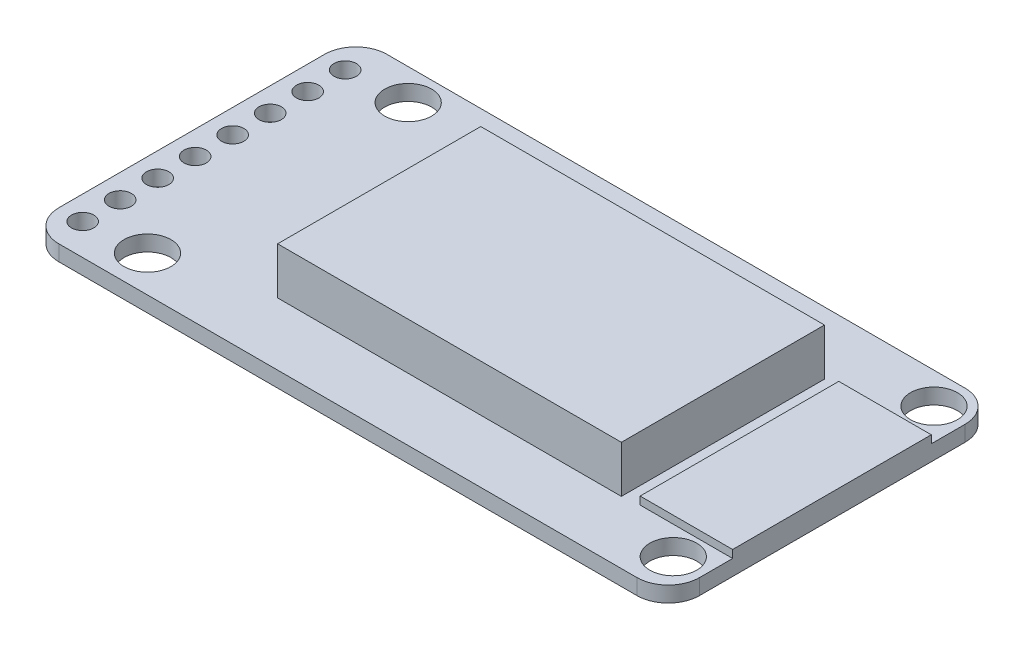
ISO-10303-21;
HEADER;
FILE_DESCRIPTION(('STEP AP214'),'2;1');
FILE_NAME('part.step','',(''),(''),'','','');
FILE_SCHEMA(('AUTOMOTIVE_DESIGN { 1 0 10303 214 1 1 1 1 }'));
ENDSEC;
DATA;
#1=APPLICATION_CONTEXT('core data for automotive mechanical design processes');
#2=APPLICATION_PROTOCOL_DEFINITION('international standard','automotive_design',2000,#1);
#3=PRODUCT_CONTEXT('',#1,'mechanical');
#4=PRODUCT('Part','Part','',(#3));
#5=PRODUCT_RELATED_PRODUCT_CATEGORY('part','',(#4));
#6=PRODUCT_DEFINITION_FORMATION('','',#4);
#7=PRODUCT_DEFINITION_CONTEXT('part definition',#1,'design');
#8=PRODUCT_DEFINITION('design','',#6,#7);
#9=PRODUCT_DEFINITION_SHAPE('','',#8);
#10=(LENGTH_UNIT() NAMED_UNIT(*) SI_UNIT(.MILLI.,.METRE.));
#11=(NAMED_UNIT(*) PLANE_ANGLE_UNIT() SI_UNIT($,.RADIAN.));
#12=(NAMED_UNIT(*) SI_UNIT($,.STERADIAN.) SOLID_ANGLE_UNIT());
#13=UNCERTAINTY_MEASURE_WITH_UNIT(LENGTH_MEASURE(1.E-05),#10,'distance_accuracy_value','');
#14=(GEOMETRIC_REPRESENTATION_CONTEXT(3) GLOBAL_UNCERTAINTY_ASSIGNED_CONTEXT((#13)) GLOBAL_UNIT_ASSIGNED_CONTEXT((#10,
#11,#12)) REPRESENTATION_CONTEXT('',''));
#15=CARTESIAN_POINT('',(0.,0.,0.));
#16=DIRECTION('',(0.,0.,1.));
#17=DIRECTION('',(1.,0.,0.));
#18=AXIS2_PLACEMENT_3D('',#15,#16,#17);
#19=CARTESIAN_POINT('',(0.,1.,0.));
#20=DIRECTION('',(0.,1.,0.));
#21=DIRECTION('',(0.,0.,1.));
#22=AXIS2_PLACEMENT_3D('',#19,#20,#21);
#23=PLANE('',#22);
#24=DIRECTION('',(0.,0.,-1.));
#25=VECTOR('',#24,1.);
#26=CARTESIAN_POINT('',(-8.49999999999999,1.,-10.5));
#27=LINE('',#26,#25);
#28=CARTESIAN_POINT('',(-8.49999999999999,1.,6.5));
#29=VERTEX_POINT('',#28);
#30=CARTESIAN_POINT('',(-8.49999999999999,1.,-6.5));
#31=VERTEX_POINT('',#30);
#32=EDGE_CURVE('E282',#29,#31,#27,.T.);
#33=ORIENTED_EDGE('',*,*,#32,.T.);
#34=DIRECTION('',(-1.,0.,0.));
#35=VECTOR('',#34,1.);
#36=CARTESIAN_POINT('',(-8.49999999999999,1.,-6.5));
#37=LINE('',#36,#35);
#38=CARTESIAN_POINT('',(13.5,1.,-6.5));
#39=VERTEX_POINT('',#38);
#40=EDGE_CURVE('E253',#39,#31,#37,.T.);
#41=ORIENTED_EDGE('',*,*,#40,.F.);
#42=DIRECTION('',(0.,0.,1.));
#43=VECTOR('',#42,1.);
#44=CARTESIAN_POINT('',(13.5,1.,-10.5));
#45=LINE('',#44,#43);
#46=CARTESIAN_POINT('',(13.5,1.,6.49999999999999));
#47=VERTEX_POINT('',#46);
#48=EDGE_CURVE('E274',#39,#47,#45,.T.);
#49=ORIENTED_EDGE('',*,*,#48,.T.);
#50=DIRECTION('',(1.,0.,0.));
#51=VECTOR('',#50,1.);
#52=CARTESIAN_POINT('',(-8.49999999999999,1.,6.5));
#53=LINE('',#52,#51);
#54=EDGE_CURVE('E251',#29,#47,#53,.T.);
#55=ORIENTED_EDGE('',*,*,#54,.F.);
#56=EDGE_LOOP('',(#33,#41,#49,#55));
#57=FACE_BOUND('',#56,.T.);
#58=CARTESIAN_POINT('',(-18.9757972728076,1.,8.49999999999999));
#59=DIRECTION('',(0.,1.,0.));
#60=DIRECTION('',(0.,0.,1.));
#61=AXIS2_PLACEMENT_3D('',#58,#59,#60);
#62=CIRCLE('',#61,0.71529936997648);
#63=CARTESIAN_POINT('',(-18.9757972728076,1.,9.21529936997647));
#64=VERTEX_POINT('',#63);
#65=EDGE_CURVE('E244',#64,#64,#62,.T.);
#66=ORIENTED_EDGE('',*,*,#65,.F.);
#67=EDGE_LOOP('',(#66));
#68=FACE_BOUND('',#67,.T.);
#69=CARTESIAN_POINT('',(-18.9757972728076,1.,6.1));
#70=DIRECTION('',(0.,1.,0.));
#71=DIRECTION('',(0.,0.,1.));
#72=AXIS2_PLACEMENT_3D('',#69,#70,#71);
#73=CIRCLE('',#72,0.71529936997648);
#74=CARTESIAN_POINT('',(-18.9757972728076,1.,6.81529936997648));
#75=VERTEX_POINT('',#74);
#76=EDGE_CURVE('E238',#75,#75,#73,.T.);
#77=ORIENTED_EDGE('',*,*,#76,.F.);
#78=EDGE_LOOP('',(#77));
#79=FACE_BOUND('',#78,.T.);
#80=CARTESIAN_POINT('',(-18.9757972728076,1.,3.7));
#81=DIRECTION('',(0.,1.,0.));
#82=DIRECTION('',(0.,0.,1.));
#83=AXIS2_PLACEMENT_3D('',#80,#81,#82);
#84=CIRCLE('',#83,0.71529936997648);
#85=CARTESIAN_POINT('',(-18.9757972728076,1.,4.41529936997648));
#86=VERTEX_POINT('',#85);
#87=EDGE_CURVE('E232',#86,#86,#84,.T.);
#88=ORIENTED_EDGE('',*,*,#87,.F.);
#89=EDGE_LOOP('',(#88));
#90=FACE_BOUND('',#89,.T.);
#91=CARTESIAN_POINT('',(-18.9757972728076,1.,1.3));
#92=DIRECTION('',(0.,1.,0.));
#93=DIRECTION('',(0.,0.,1.));
#94=AXIS2_PLACEMENT_3D('',#91,#92,#93);
#95=CIRCLE('',#94,0.71529936997648);
#96=CARTESIAN_POINT('',(-18.9757972728076,1.,2.01529936997648));
#97=VERTEX_POINT('',#96);
#98=EDGE_CURVE('E226',#97,#97,#95,.T.);
#99=ORIENTED_EDGE('',*,*,#98,.F.);
#100=EDGE_LOOP('',(#99));
#101=FACE_BOUND('',#100,.T.);
#102=CARTESIAN_POINT('',(-18.9757972728076,1.,-1.1));
#103=DIRECTION('',(0.,1.,0.));
#104=DIRECTION('',(0.,0.,1.));
#105=AXIS2_PLACEMENT_3D('',#102,#103,#104);
#106=CIRCLE('',#105,0.71529936997648);
#107=CARTESIAN_POINT('',(-18.9757972728076,1.,-0.384700630023524));
#108=VERTEX_POINT('',#107);
#109=EDGE_CURVE('E220',#108,#108,#106,.T.);
#110=ORIENTED_EDGE('',*,*,#109,.F.);
#111=EDGE_LOOP('',(#110));
#112=FACE_BOUND('',#111,.T.);
#113=CARTESIAN_POINT('',(-18.9757972728076,1.,-3.5));
#114=DIRECTION('',(0.,1.,0.));
#115=DIRECTION('',(0.,0.,1.));
#116=AXIS2_PLACEMENT_3D('',#113,#114,#115);
#117=CIRCLE('',#116,0.71529936997648);
#118=CARTESIAN_POINT('',(-18.9757972728076,1.,-2.78470063002352));
#119=VERTEX_POINT('',#118);
#120=EDGE_CURVE('E214',#119,#119,#117,.T.);
#121=ORIENTED_EDGE('',*,*,#120,.F.);
#122=EDGE_LOOP('',(#121));
#123=FACE_BOUND('',#122,.T.);
#124=CARTESIAN_POINT('',(-18.9757972728076,1.,-5.9));
#125=DIRECTION('',(0.,1.,0.));
#126=DIRECTION('',(0.,0.,1.));
#127=AXIS2_PLACEMENT_3D('',#124,#125,#126);
#128=CIRCLE('',#127,0.71529936997648);
#129=CARTESIAN_POINT('',(-18.9757972728076,1.,-5.18470063002352));
#130=VERTEX_POINT('',#129);
#131=EDGE_CURVE('E208',#130,#130,#128,.T.);
#132=ORIENTED_EDGE('',*,*,#131,.F.);
#133=EDGE_LOOP('',(#132));
#134=FACE_BOUND('',#133,.T.);
#135=CARTESIAN_POINT('',(-18.9757972728076,1.,-8.3));
#136=DIRECTION('',(0.,1.,0.));
#137=DIRECTION('',(0.,0.,1.));
#138=AXIS2_PLACEMENT_3D('',#135,#136,#137);
#139=CIRCLE('',#138,0.71529936997648);
#140=CARTESIAN_POINT('',(-18.9757972728076,1.,-7.58470063002352));
#141=VERTEX_POINT('',#140);
#142=EDGE_CURVE('E202',#141,#141,#139,.T.);
#143=ORIENTED_EDGE('',*,*,#142,.F.);
#144=EDGE_LOOP('',(#143));
#145=FACE_BOUND('',#144,.T.);
#146=CARTESIAN_POINT('',(-15.1499628617966,1.,-8.50645559511954));
#147=DIRECTION('',(0.,1.,0.));
#148=DIRECTION('',(0.,0.,1.));
#149=AXIS2_PLACEMENT_3D('',#146,#147,#148);
#150=CIRCLE('',#149,1.5);
#151=CARTESIAN_POINT('',(-15.1499628617966,1.,-7.00645559511953));
#152=VERTEX_POINT('',#151);
#153=EDGE_CURVE('E196',#152,#152,#150,.T.);
#154=ORIENTED_EDGE('',*,*,#153,.F.);
#155=EDGE_LOOP('',(#154));
#156=FACE_BOUND('',#155,.T.);
#157=CARTESIAN_POINT('',(18.5,1.,-8.50645559511954));
#158=DIRECTION('',(0.,1.,0.));
#159=DIRECTION('',(0.,0.,1.));
#160=AXIS2_PLACEMENT_3D('',#157,#158,#159);
#161=CIRCLE('',#160,1.5);
#162=CARTESIAN_POINT('',(18.5,1.,-7.00645559511953));
#163=VERTEX_POINT('',#162);
#164=EDGE_CURVE('E190',#163,#163,#161,.T.);
#165=ORIENTED_EDGE('',*,*,#164,.F.);
#166=EDGE_LOOP('',(#165));
#167=FACE_BOUND('',#166,.T.);
#168=CARTESIAN_POINT('',(-15.1499628617966,1.,8.17817223405615));
#169=DIRECTION('',(0.,1.,0.));
#170=DIRECTION('',(0.,0.,1.));
#171=AXIS2_PLACEMENT_3D('',#168,#169,#170);
#172=CIRCLE('',#171,1.5);
#173=CARTESIAN_POINT('',(-15.1499628617966,1.,9.67817223405615));
#174=VERTEX_POINT('',#173);
#175=EDGE_CURVE('E184',#174,#174,#172,.T.);
#176=ORIENTED_EDGE('',*,*,#175,.F.);
#177=EDGE_LOOP('',(#176));
#178=FACE_BOUND('',#177,.T.);
#179=CARTESIAN_POINT('',(18.5,1.,8.17817223405614));
#180=DIRECTION('',(0.,1.,0.));
#181=DIRECTION('',(0.,0.,1.));
#182=AXIS2_PLACEMENT_3D('',#179,#180,#181);
#183=CIRCLE('',#182,1.5);
#184=CARTESIAN_POINT('',(18.5,1.,9.67817223405615));
#185=VERTEX_POINT('',#184);
#186=EDGE_CURVE('E174',#185,#185,#183,.T.);
#187=ORIENTED_EDGE('',*,*,#186,.F.);
#188=EDGE_LOOP('',(#187));
#189=FACE_BOUND('',#188,.T.);
#190=DIRECTION('',(0.,0.,1.));
#191=VECTOR('',#190,1.);
#192=CARTESIAN_POINT('',(14.5804071199531,1.,-6.33314280088722));
#193=LINE('',#192,#191);
#194=CARTESIAN_POINT('',(14.5804071199531,1.,-6.33314280088722));
#195=VERTEX_POINT('',#194);
#196=CARTESIAN_POINT('',(14.5804071199531,1.,6.38040506059535));
#197=VERTEX_POINT('',#196);
#198=EDGE_CURVE('E368',#195,#197,#193,.T.);
#199=ORIENTED_EDGE('',*,*,#198,.F.);
#200=DIRECTION('',(-1.,0.,0.));
#201=VECTOR('',#200,1.);
#202=CARTESIAN_POINT('',(20.5,1.,-6.33314280088722));
#203=LINE('',#202,#201);
#204=CARTESIAN_POINT('',(20.5,1.,-6.33314280088722));
#205=VERTEX_POINT('',#204);
#206=EDGE_CURVE('E370',#205,#195,#203,.T.);
#207=ORIENTED_EDGE('',*,*,#206,.F.);
#208=DIRECTION('',(0.,0.,-1.));
#209=VECTOR('',#208,1.);
#210=CARTESIAN_POINT('',(20.5,1.,-10.5));
#211=LINE('',#210,#209);
#212=CARTESIAN_POINT('',(20.5,1.,-8.5));
#213=VERTEX_POINT('',#212);
#214=EDGE_CURVE('E173',#205,#213,#211,.T.);
#215=ORIENTED_EDGE('',*,*,#214,.T.);
#216=CARTESIAN_POINT('',(18.5,1.,-8.5));
#217=DIRECTION('',(0.,1.,0.));
#218=DIRECTION('',(0.,0.,1.));
#219=AXIS2_PLACEMENT_3D('',#216,#217,#218);
#220=CIRCLE('',#219,2.);
#221=CARTESIAN_POINT('',(18.5,1.,-10.5));
#222=VERTEX_POINT('',#221);
#223=EDGE_CURVE('E322',#213,#222,#220,.T.);
#224=ORIENTED_EDGE('',*,*,#223,.T.);
#225=DIRECTION('',(-1.,0.,0.));
#226=VECTOR('',#225,1.);
#227=CARTESIAN_POINT('',(-20.5,1.,-10.5));
#228=LINE('',#227,#226);
#229=CARTESIAN_POINT('',(-18.5,1.,-10.5));
#230=VERTEX_POINT('',#229);
#231=EDGE_CURVE('E285',#222,#230,#228,.T.);
#232=ORIENTED_EDGE('',*,*,#231,.T.);
#233=CARTESIAN_POINT('',(-18.5,1.,-8.5));
#234=DIRECTION('',(0.,1.,0.));
#235=DIRECTION('',(0.,0.,1.));
#236=AXIS2_PLACEMENT_3D('',#233,#234,#235);
#237=CIRCLE('',#236,2.);
#238=CARTESIAN_POINT('',(-20.5,1.,-8.5));
#239=VERTEX_POINT('',#238);
#240=EDGE_CURVE('E326',#230,#239,#237,.T.);
#241=ORIENTED_EDGE('',*,*,#240,.T.);
#242=DIRECTION('',(0.,0.,1.));
#243=VECTOR('',#242,1.);
#244=CARTESIAN_POINT('',(-20.5,1.,-10.5));
#245=LINE('',#244,#243);
#246=CARTESIAN_POINT('',(-20.5,1.,8.49999999999999));
#247=VERTEX_POINT('',#246);
#248=EDGE_CURVE('E277',#239,#247,#245,.T.);
#249=ORIENTED_EDGE('',*,*,#248,.T.);
#250=CARTESIAN_POINT('',(-18.5,1.,8.5));
#251=DIRECTION('',(0.,1.,0.));
#252=DIRECTION('',(0.,0.,1.));
#253=AXIS2_PLACEMENT_3D('',#250,#251,#252);
#254=CIRCLE('',#253,2.);
#255=CARTESIAN_POINT('',(-18.5,1.,10.5));
#256=VERTEX_POINT('',#255);
#257=EDGE_CURVE('E328',#247,#256,#254,.T.);
#258=ORIENTED_EDGE('',*,*,#257,.T.);
#259=DIRECTION('',(1.,0.,0.));
#260=VECTOR('',#259,1.);
#261=CARTESIAN_POINT('',(-20.5,1.,10.5));
#262=LINE('',#261,#260);
#263=CARTESIAN_POINT('',(18.5,1.,10.5));
#264=VERTEX_POINT('',#263);
#265=EDGE_CURVE('E301',#256,#264,#262,.T.);
#266=ORIENTED_EDGE('',*,*,#265,.T.);
#267=CARTESIAN_POINT('',(18.5,1.,8.5));
#268=DIRECTION('',(0.,1.,0.));
#269=DIRECTION('',(0.,0.,1.));
#270=AXIS2_PLACEMENT_3D('',#267,#268,#269);
#271=CIRCLE('',#270,2.);
#272=CARTESIAN_POINT('',(20.5,1.,8.49999999999999));
#273=VERTEX_POINT('',#272);
#274=EDGE_CURVE('E324',#264,#273,#271,.T.);
#275=ORIENTED_EDGE('',*,*,#274,.T.);
#276=CARTESIAN_POINT('',(20.5,1.,6.38040506059535));
#277=VERTEX_POINT('',#276);
#278=EDGE_CURVE('E271',#273,#277,#211,.T.);
#279=ORIENTED_EDGE('',*,*,#278,.T.);
#280=DIRECTION('',(1.,0.,0.));
#281=VECTOR('',#280,1.);
#282=CARTESIAN_POINT('',(20.5,1.,6.38040506059535));
#283=LINE('',#282,#281);
#284=EDGE_CURVE('E167',#197,#277,#283,.T.);
#285=ORIENTED_EDGE('',*,*,#284,.F.);
#286=EDGE_LOOP('',(#199,#207,#215,#224,#232,#241,#249,#258,#266,#275,#279,#285));
#287=FACE_BOUND('',#286,.T.);
#288=ADVANCED_FACE('F33',(#57,#68,#79,#90,#101,#112,#123,#134,#145,#156,#167,#178,#189,#287),
#23,.T.);
#289=CARTESIAN_POINT('',(-20.5,4.,-10.5));
#290=DIRECTION('',(0.,0.,1.));
#291=DIRECTION('',(1.,0.,0.));
#292=AXIS2_PLACEMENT_3D('',#289,#290,#291);
#293=PLANE('',#292);
#294=DIRECTION('',(-1.,0.,0.));
#295=VECTOR('',#294,1.);
#296=CARTESIAN_POINT('',(-20.5,0.,-10.5));
#297=LINE('',#296,#295);
#298=CARTESIAN_POINT('',(18.5,0.,-10.5));
#299=VERTEX_POINT('',#298);
#300=CARTESIAN_POINT('',(-18.5,0.,-10.5));
#301=VERTEX_POINT('',#300);
#302=EDGE_CURVE('E290',#299,#301,#297,.T.);
#303=ORIENTED_EDGE('',*,*,#302,.T.);
#304=DIRECTION('',(0.,-1.,0.));
#305=VECTOR('',#304,1.);
#306=CARTESIAN_POINT('',(-18.5,4.,-10.5));
#307=LINE('',#306,#305);
#308=EDGE_CURVE('E56',#301,#230,#307,.F.);
#309=ORIENTED_EDGE('',*,*,#308,.T.);
#310=ORIENTED_EDGE('',*,*,#231,.F.);
#311=DIRECTION('',(0.,-1.,0.));
#312=VECTOR('',#311,1.);
#313=CARTESIAN_POINT('',(18.5,4.,-10.5));
#314=LINE('',#313,#312);
#315=EDGE_CURVE('E330',#222,#299,#314,.T.);
#316=ORIENTED_EDGE('',*,*,#315,.T.);
#317=EDGE_LOOP('',(#303,#309,#310,#316));
#318=FACE_BOUND('',#317,.T.);
#319=ADVANCED_FACE('F341',(#318),#293,.F.);
#320=CARTESIAN_POINT('',(-20.5,4.,10.5));
#321=DIRECTION('',(0.,0.,-1.));
#322=DIRECTION('',(-1.,0.,0.));
#323=AXIS2_PLACEMENT_3D('',#320,#321,#322);
#324=PLANE('',#323);
#325=ORIENTED_EDGE('',*,*,#265,.F.);
#326=DIRECTION('',(0.,-1.,0.));
#327=VECTOR('',#326,1.);
#328=CARTESIAN_POINT('',(-18.5,4.,10.5));
#329=LINE('',#328,#327);
#330=CARTESIAN_POINT('',(-18.5,0.,10.5));
#331=VERTEX_POINT('',#330);
#332=EDGE_CURVE('E306',#256,#331,#329,.T.);
#333=ORIENTED_EDGE('',*,*,#332,.T.);
#334=DIRECTION('',(1.,0.,0.));
#335=VECTOR('',#334,1.);
#336=CARTESIAN_POINT('',(-20.5,0.,10.5));
#337=LINE('',#336,#335);
#338=CARTESIAN_POINT('',(18.5,0.,10.5));
#339=VERTEX_POINT('',#338);
#340=EDGE_CURVE('E295',#331,#339,#337,.T.);
#341=ORIENTED_EDGE('',*,*,#340,.T.);
#342=DIRECTION('',(0.,-1.,0.));
#343=VECTOR('',#342,1.);
#344=CARTESIAN_POINT('',(18.5,4.,10.5));
#345=LINE('',#344,#343);
#346=EDGE_CURVE('E304',#339,#264,#345,.F.);
#347=ORIENTED_EDGE('',*,*,#346,.T.);
#348=EDGE_LOOP('',(#325,#333,#341,#347));
#349=FACE_BOUND('',#348,.T.);
#350=ADVANCED_FACE('F360',(#349),#324,.F.);
#351=CARTESIAN_POINT('',(0.,4.,0.));
#352=DIRECTION('',(0.,-1.,0.));
#353=DIRECTION('',(0.,0.,-1.));
#354=AXIS2_PLACEMENT_3D('',#351,#352,#353);
#355=PLANE('',#354);
#356=DIRECTION('',(-1.,0.,0.));
#357=VECTOR('',#356,1.);
#358=CARTESIAN_POINT('',(-8.49999999999999,4.,-6.5));
#359=LINE('',#358,#357);
#360=CARTESIAN_POINT('',(13.5,4.,-6.5));
#361=VERTEX_POINT('',#360);
#362=CARTESIAN_POINT('',(-8.49999999999999,4.,-6.5));
#363=VERTEX_POINT('',#362);
#364=EDGE_CURVE('E254',#361,#363,#359,.T.);
#365=ORIENTED_EDGE('',*,*,#364,.T.);
#366=DIRECTION('',(0.,0.,1.));
#367=VECTOR('',#366,1.);
#368=CARTESIAN_POINT('',(-8.49999999999999,4.,0.));
#369=LINE('',#368,#367);
#370=CARTESIAN_POINT('',(-8.49999999999999,4.,6.5));
#371=VERTEX_POINT('',#370);
#372=EDGE_CURVE('E298',#363,#371,#369,.T.);
#373=ORIENTED_EDGE('',*,*,#372,.T.);
#374=DIRECTION('',(1.,0.,0.));
#375=VECTOR('',#374,1.);
#376=CARTESIAN_POINT('',(-8.49999999999999,4.,6.5));
#377=LINE('',#376,#375);
#378=CARTESIAN_POINT('',(13.5,4.,6.5));
#379=VERTEX_POINT('',#378);
#380=EDGE_CURVE('E250',#371,#379,#377,.T.);
#381=ORIENTED_EDGE('',*,*,#380,.T.);
#382=DIRECTION('',(0.,0.,1.));
#383=VECTOR('',#382,1.);
#384=CARTESIAN_POINT('',(13.5,4.,-10.5));
#385=LINE('',#384,#383);
#386=EDGE_CURVE('E263',#361,#379,#385,.T.);
#387=ORIENTED_EDGE('',*,*,#386,.F.);
#388=EDGE_LOOP('',(#365,#373,#381,#387));
#389=FACE_BOUND('',#388,.T.);
#390=ADVANCED_FACE('F402',(#389),#355,.F.);
#391=CARTESIAN_POINT('',(-8.49999999999999,1.,-10.5));
#392=DIRECTION('',(1.,0.,0.));
#393=DIRECTION('',(0.,0.,-1.));
#394=AXIS2_PLACEMENT_3D('',#391,#392,#393);
#395=PLANE('',#394);
#396=DIRECTION('',(0.,1.,0.));
#397=VECTOR('',#396,1.);
#398=CARTESIAN_POINT('',(-8.49999999999999,1.,-6.5));
#399=LINE('',#398,#397);
#400=EDGE_CURVE('E261',#31,#363,#399,.T.);
#401=ORIENTED_EDGE('',*,*,#400,.F.);
#402=ORIENTED_EDGE('',*,*,#32,.F.);
#403=DIRECTION('',(0.,1.,0.));
#404=VECTOR('',#403,1.);
#405=CARTESIAN_POINT('',(-8.49999999999999,1.,6.5));
#406=LINE('',#405,#404);
#407=EDGE_CURVE('E256',#29,#371,#406,.T.);
#408=ORIENTED_EDGE('',*,*,#407,.T.);
#409=ORIENTED_EDGE('',*,*,#372,.F.);
#410=EDGE_LOOP('',(#401,#402,#408,#409));
#411=FACE_BOUND('',#410,.T.);
#412=ADVANCED_FACE('F399',(#411),#395,.F.);
#413=CARTESIAN_POINT('',(13.5,1.,-10.5));
#414=DIRECTION('',(-1.,0.,0.));
#415=DIRECTION('',(0.,0.,1.));
#416=AXIS2_PLACEMENT_3D('',#413,#414,#415);
#417=PLANE('',#416);
#418=DIRECTION('',(0.,1.,0.));
#419=VECTOR('',#418,1.);
#420=CARTESIAN_POINT('',(13.5,1.,-6.5));
#421=LINE('',#420,#419);
#422=EDGE_CURVE('E264',#39,#361,#421,.T.);
#423=ORIENTED_EDGE('',*,*,#422,.T.);
#424=ORIENTED_EDGE('',*,*,#386,.T.);
#425=DIRECTION('',(0.,1.,0.));
#426=VECTOR('',#425,1.);
#427=CARTESIAN_POINT('',(13.5,1.,6.5));
#428=LINE('',#427,#426);
#429=EDGE_CURVE('E267',#47,#379,#428,.T.);
#430=ORIENTED_EDGE('',*,*,#429,.F.);
#431=ORIENTED_EDGE('',*,*,#48,.F.);
#432=EDGE_LOOP('',(#423,#424,#430,#431));
#433=FACE_BOUND('',#432,.T.);
#434=ADVANCED_FACE('F397',(#433),#417,.F.);
#435=CARTESIAN_POINT('',(20.5,4.,10.5));
#436=DIRECTION('',(-1.,0.,0.));
#437=DIRECTION('',(0.,0.,1.));
#438=AXIS2_PLACEMENT_3D('',#435,#436,#437);
#439=PLANE('',#438);
#440=ORIENTED_EDGE('',*,*,#278,.F.);
#441=DIRECTION('',(0.,-1.,0.));
#442=VECTOR('',#441,1.);
#443=CARTESIAN_POINT('',(20.5,4.,8.5));
#444=LINE('',#443,#442);
#445=CARTESIAN_POINT('',(20.5,0.,8.5));
#446=VERTEX_POINT('',#445);
#447=EDGE_CURVE('E12',#273,#446,#444,.T.);
#448=ORIENTED_EDGE('',*,*,#447,.T.);
#449=DIRECTION('',(0.,0.,-1.));
#450=VECTOR('',#449,1.);
#451=CARTESIAN_POINT('',(20.5,0.,10.5));
#452=LINE('',#451,#450);
#453=CARTESIAN_POINT('',(20.5,0.,-8.49999999999999));
#454=VERTEX_POINT('',#453);
#455=EDGE_CURVE('E287',#446,#454,#452,.T.);
#456=ORIENTED_EDGE('',*,*,#455,.T.);
#457=DIRECTION('',(0.,-1.,0.));
#458=VECTOR('',#457,1.);
#459=CARTESIAN_POINT('',(20.5,4.,-8.5));
#460=LINE('',#459,#458);
#461=EDGE_CURVE('E41',#454,#213,#460,.F.);
#462=ORIENTED_EDGE('',*,*,#461,.T.);
#463=ORIENTED_EDGE('',*,*,#214,.F.);
#464=DIRECTION('',(0.,-1.,0.));
#465=VECTOR('',#464,1.);
#466=CARTESIAN_POINT('',(20.5,1.5,-6.33314280088722));
#467=LINE('',#466,#465);
#468=CARTESIAN_POINT('',(20.5,1.5,-6.33314280088722));
#469=VERTEX_POINT('',#468);
#470=EDGE_CURVE('E152',#469,#205,#467,.T.);
#471=ORIENTED_EDGE('',*,*,#470,.F.);
#472=DIRECTION('',(0.,0.,-1.));
#473=VECTOR('',#472,1.);
#474=CARTESIAN_POINT('',(20.5,1.5,-6.33314280088722));
#475=LINE('',#474,#473);
#476=CARTESIAN_POINT('',(20.5,1.5,6.38040506059535));
#477=VERTEX_POINT('',#476);
#478=EDGE_CURVE('E159',#477,#469,#475,.T.);
#479=ORIENTED_EDGE('',*,*,#478,.F.);
#480=DIRECTION('',(0.,-1.,0.));
#481=VECTOR('',#480,1.);
#482=CARTESIAN_POINT('',(20.5,1.5,6.38040506059535));
#483=LINE('',#482,#481);
#484=EDGE_CURVE('E366',#477,#277,#483,.T.);
#485=ORIENTED_EDGE('',*,*,#484,.T.);
#486=EDGE_LOOP('',(#440,#448,#456,#462,#463,#471,#479,#485));
#487=FACE_BOUND('',#486,.T.);
#488=ADVANCED_FACE('F171',(#487),#439,.F.);
#489=CARTESIAN_POINT('',(-20.5,4.,10.5));
#490=DIRECTION('',(1.,0.,0.));
#491=DIRECTION('',(0.,0.,-1.));
#492=AXIS2_PLACEMENT_3D('',#489,#490,#491);
#493=PLANE('',#492);
#494=DIRECTION('',(0.,0.,1.));
#495=VECTOR('',#494,1.);
#496=CARTESIAN_POINT('',(-20.5,0.,10.5));
#497=LINE('',#496,#495);
#498=CARTESIAN_POINT('',(-20.5,0.,-8.49999999999999));
#499=VERTEX_POINT('',#498);
#500=CARTESIAN_POINT('',(-20.5,0.,8.5));
#501=VERTEX_POINT('',#500);
#502=EDGE_CURVE('E292',#499,#501,#497,.T.);
#503=ORIENTED_EDGE('',*,*,#502,.T.);
#504=DIRECTION('',(0.,-1.,0.));
#505=VECTOR('',#504,1.);
#506=CARTESIAN_POINT('',(-20.5,4.,8.5));
#507=LINE('',#506,#505);
#508=EDGE_CURVE('E320',#501,#247,#507,.F.);
#509=ORIENTED_EDGE('',*,*,#508,.T.);
#510=ORIENTED_EDGE('',*,*,#248,.F.);
#511=DIRECTION('',(0.,-1.,0.));
#512=VECTOR('',#511,1.);
#513=CARTESIAN_POINT('',(-20.5,4.,-8.5));
#514=LINE('',#513,#512);
#515=EDGE_CURVE('E317',#239,#499,#514,.T.);
#516=ORIENTED_EDGE('',*,*,#515,.T.);
#517=EDGE_LOOP('',(#503,#509,#510,#516));
#518=FACE_BOUND('',#517,.T.);
#519=ADVANCED_FACE('F352',(#518),#493,.F.);
#520=CARTESIAN_POINT('',(0.,0.,0.));
#521=DIRECTION('',(0.,-1.,0.));
#522=DIRECTION('',(0.,0.,-1.));
#523=AXIS2_PLACEMENT_3D('',#520,#521,#522);
#524=PLANE('',#523);
#525=CARTESIAN_POINT('',(18.5,0.,8.17817223405614));
#526=DIRECTION('',(0.,-1.,0.));
#527=DIRECTION('',(0.,0.,-1.));
#528=AXIS2_PLACEMENT_3D('',#525,#526,#527);
#529=CIRCLE('',#528,1.5);
#530=CARTESIAN_POINT('',(18.5,0.,6.67817223405614));
#531=VERTEX_POINT('',#530);
#532=EDGE_CURVE('E177',#531,#531,#529,.T.);
#533=ORIENTED_EDGE('',*,*,#532,.F.);
#534=EDGE_LOOP('',(#533));
#535=FACE_BOUND('',#534,.T.);
#536=CARTESIAN_POINT('',(-15.1499628617966,0.,8.17817223405615));
#537=DIRECTION('',(0.,-1.,0.));
#538=DIRECTION('',(0.,0.,-1.));
#539=AXIS2_PLACEMENT_3D('',#536,#537,#538);
#540=CIRCLE('',#539,1.5);
#541=CARTESIAN_POINT('',(-15.1499628617966,0.,6.67817223405615));
#542=VERTEX_POINT('',#541);
#543=EDGE_CURVE('E187',#542,#542,#540,.T.);
#544=ORIENTED_EDGE('',*,*,#543,.F.);
#545=EDGE_LOOP('',(#544));
#546=FACE_BOUND('',#545,.T.);
#547=CARTESIAN_POINT('',(18.5,0.,-8.50645559511954));
#548=DIRECTION('',(0.,-1.,0.));
#549=DIRECTION('',(0.,0.,-1.));
#550=AXIS2_PLACEMENT_3D('',#547,#548,#549);
#551=CIRCLE('',#550,1.5);
#552=CARTESIAN_POINT('',(18.5,0.,-10.0064555951195));
#553=VERTEX_POINT('',#552);
#554=EDGE_CURVE('E193',#553,#553,#551,.T.);
#555=ORIENTED_EDGE('',*,*,#554,.F.);
#556=EDGE_LOOP('',(#555));
#557=FACE_BOUND('',#556,.T.);
#558=CARTESIAN_POINT('',(-15.1499628617966,0.,-8.50645559511954));
#559=DIRECTION('',(0.,-1.,0.));
#560=DIRECTION('',(0.,0.,-1.));
#561=AXIS2_PLACEMENT_3D('',#558,#559,#560);
#562=CIRCLE('',#561,1.5);
#563=CARTESIAN_POINT('',(-15.1499628617966,0.,-10.0064555951195));
#564=VERTEX_POINT('',#563);
#565=EDGE_CURVE('E199',#564,#564,#562,.T.);
#566=ORIENTED_EDGE('',*,*,#565,.F.);
#567=EDGE_LOOP('',(#566));
#568=FACE_BOUND('',#567,.T.);
#569=CARTESIAN_POINT('',(-18.9757972728076,0.,-8.3));
#570=DIRECTION('',(0.,-1.,0.));
#571=DIRECTION('',(0.,0.,-1.));
#572=AXIS2_PLACEMENT_3D('',#569,#570,#571);
#573=CIRCLE('',#572,0.71529936997648);
#574=CARTESIAN_POINT('',(-18.9757972728076,0.,-9.01529936997648));
#575=VERTEX_POINT('',#574);
#576=EDGE_CURVE('E205',#575,#575,#573,.T.);
#577=ORIENTED_EDGE('',*,*,#576,.F.);
#578=EDGE_LOOP('',(#577));
#579=FACE_BOUND('',#578,.T.);
#580=CARTESIAN_POINT('',(-18.9757972728076,0.,-5.9));
#581=DIRECTION('',(0.,-1.,0.));
#582=DIRECTION('',(0.,0.,-1.));
#583=AXIS2_PLACEMENT_3D('',#580,#581,#582);
#584=CIRCLE('',#583,0.71529936997648);
#585=CARTESIAN_POINT('',(-18.9757972728076,0.,-6.61529936997648));
#586=VERTEX_POINT('',#585);
#587=EDGE_CURVE('E211',#586,#586,#584,.T.);
#588=ORIENTED_EDGE('',*,*,#587,.F.);
#589=EDGE_LOOP('',(#588));
#590=FACE_BOUND('',#589,.T.);
#591=CARTESIAN_POINT('',(-18.9757972728076,0.,-3.5));
#592=DIRECTION('',(0.,-1.,0.));
#593=DIRECTION('',(0.,0.,-1.));
#594=AXIS2_PLACEMENT_3D('',#591,#592,#593);
#595=CIRCLE('',#594,0.71529936997648);
#596=CARTESIAN_POINT('',(-18.9757972728076,0.,-4.21529936997648));
#597=VERTEX_POINT('',#596);
#598=EDGE_CURVE('E217',#597,#597,#595,.T.);
#599=ORIENTED_EDGE('',*,*,#598,.F.);
#600=EDGE_LOOP('',(#599));
#601=FACE_BOUND('',#600,.T.);
#602=CARTESIAN_POINT('',(-18.9757972728076,0.,-1.1));
#603=DIRECTION('',(0.,-1.,0.));
#604=DIRECTION('',(0.,0.,-1.));
#605=AXIS2_PLACEMENT_3D('',#602,#603,#604);
#606=CIRCLE('',#605,0.71529936997648);
#607=CARTESIAN_POINT('',(-18.9757972728076,0.,-1.81529936997648));
#608=VERTEX_POINT('',#607);
#609=EDGE_CURVE('E223',#608,#608,#606,.T.);
#610=ORIENTED_EDGE('',*,*,#609,.F.);
#611=EDGE_LOOP('',(#610));
#612=FACE_BOUND('',#611,.T.);
#613=CARTESIAN_POINT('',(-18.9757972728076,0.,1.3));
#614=DIRECTION('',(0.,-1.,0.));
#615=DIRECTION('',(0.,0.,-1.));
#616=AXIS2_PLACEMENT_3D('',#613,#614,#615);
#617=CIRCLE('',#616,0.71529936997648);
#618=CARTESIAN_POINT('',(-18.9757972728076,0.,0.584700630023516));
#619=VERTEX_POINT('',#618);
#620=EDGE_CURVE('E229',#619,#619,#617,.T.);
#621=ORIENTED_EDGE('',*,*,#620,.F.);
#622=EDGE_LOOP('',(#621));
#623=FACE_BOUND('',#622,.T.);
#624=CARTESIAN_POINT('',(-18.9757972728076,0.,3.7));
#625=DIRECTION('',(0.,-1.,0.));
#626=DIRECTION('',(0.,0.,-1.));
#627=AXIS2_PLACEMENT_3D('',#624,#625,#626);
#628=CIRCLE('',#627,0.71529936997648);
#629=CARTESIAN_POINT('',(-18.9757972728076,0.,2.98470063002352));
#630=VERTEX_POINT('',#629);
#631=EDGE_CURVE('E235',#630,#630,#628,.T.);
#632=ORIENTED_EDGE('',*,*,#631,.F.);
#633=EDGE_LOOP('',(#632));
#634=FACE_BOUND('',#633,.T.);
#635=CARTESIAN_POINT('',(-18.9757972728076,0.,6.1));
#636=DIRECTION('',(0.,-1.,0.));
#637=DIRECTION('',(0.,0.,-1.));
#638=AXIS2_PLACEMENT_3D('',#635,#636,#637);
#639=CIRCLE('',#638,0.71529936997648);
#640=CARTESIAN_POINT('',(-18.9757972728076,0.,5.38470063002352));
#641=VERTEX_POINT('',#640);
#642=EDGE_CURVE('E241',#641,#641,#639,.T.);
#643=ORIENTED_EDGE('',*,*,#642,.F.);
#644=EDGE_LOOP('',(#643));
#645=FACE_BOUND('',#644,.T.);
#646=CARTESIAN_POINT('',(-18.9757972728076,0.,8.49999999999999));
#647=DIRECTION('',(0.,-1.,0.));
#648=DIRECTION('',(0.,0.,-1.));
#649=AXIS2_PLACEMENT_3D('',#646,#647,#648);
#650=CIRCLE('',#649,0.71529936997648);
#651=CARTESIAN_POINT('',(-18.9757972728076,0.,7.78470063002352));
#652=VERTEX_POINT('',#651);
#653=EDGE_CURVE('E247',#652,#652,#650,.T.);
#654=ORIENTED_EDGE('',*,*,#653,.F.);
#655=EDGE_LOOP('',(#654));
#656=FACE_BOUND('',#655,.T.);
#657=ORIENTED_EDGE('',*,*,#340,.F.);
#658=CARTESIAN_POINT('',(-18.5,0.,8.5));
#659=DIRECTION('',(0.,-1.,0.));
#660=DIRECTION('',(0.,0.,-1.));
#661=AXIS2_PLACEMENT_3D('',#658,#659,#660);
#662=CIRCLE('',#661,2.);
#663=EDGE_CURVE('E315',#331,#501,#662,.T.);
#664=ORIENTED_EDGE('',*,*,#663,.T.);
#665=ORIENTED_EDGE('',*,*,#502,.F.);
#666=CARTESIAN_POINT('',(-18.5,0.,-8.5));
#667=DIRECTION('',(0.,-1.,0.));
#668=DIRECTION('',(0.,0.,-1.));
#669=AXIS2_PLACEMENT_3D('',#666,#667,#668);
#670=CIRCLE('',#669,2.);
#671=EDGE_CURVE('E313',#499,#301,#670,.T.);
#672=ORIENTED_EDGE('',*,*,#671,.T.);
#673=ORIENTED_EDGE('',*,*,#302,.F.);
#674=CARTESIAN_POINT('',(18.5,0.,-8.5));
#675=DIRECTION('',(0.,-1.,0.));
#676=DIRECTION('',(0.,0.,-1.));
#677=AXIS2_PLACEMENT_3D('',#674,#675,#676);
#678=CIRCLE('',#677,2.);
#679=EDGE_CURVE('E309',#299,#454,#678,.T.);
#680=ORIENTED_EDGE('',*,*,#679,.T.);
#681=ORIENTED_EDGE('',*,*,#455,.F.);
#682=CARTESIAN_POINT('',(18.5,0.,8.5));
#683=DIRECTION('',(0.,-1.,0.));
#684=DIRECTION('',(0.,0.,-1.));
#685=AXIS2_PLACEMENT_3D('',#682,#683,#684);
#686=CIRCLE('',#685,2.);
#687=EDGE_CURVE('E311',#446,#339,#686,.T.);
#688=ORIENTED_EDGE('',*,*,#687,.T.);
#689=EDGE_LOOP('',(#657,#664,#665,#672,#673,#680,#681,#688));
#690=FACE_BOUND('',#689,.T.);
#691=ADVANCED_FACE('F345',(#535,#546,#557,#568,#579,#590,#601,#612,#623,#634,#645,#656,#690),
#524,.T.);
#692=CARTESIAN_POINT('',(-8.49999999999999,1.,6.5));
#693=DIRECTION('',(0.,0.,1.));
#694=DIRECTION('',(1.,0.,0.));
#695=AXIS2_PLACEMENT_3D('',#692,#693,#694);
#696=PLANE('',#695);
#697=ORIENTED_EDGE('',*,*,#380,.F.);
#698=ORIENTED_EDGE('',*,*,#407,.F.);
#699=ORIENTED_EDGE('',*,*,#54,.T.);
#700=ORIENTED_EDGE('',*,*,#429,.T.);
#701=EDGE_LOOP('',(#697,#698,#699,#700));
#702=FACE_BOUND('',#701,.T.);
#703=ADVANCED_FACE('F409',(#702),#696,.T.);
#704=CARTESIAN_POINT('',(-8.49999999999999,1.,-6.5));
#705=DIRECTION('',(0.,0.,-1.));
#706=DIRECTION('',(-1.,0.,0.));
#707=AXIS2_PLACEMENT_3D('',#704,#705,#706);
#708=PLANE('',#707);
#709=ORIENTED_EDGE('',*,*,#364,.F.);
#710=ORIENTED_EDGE('',*,*,#422,.F.);
#711=ORIENTED_EDGE('',*,*,#40,.T.);
#712=ORIENTED_EDGE('',*,*,#400,.T.);
#713=EDGE_LOOP('',(#709,#710,#711,#712));
#714=FACE_BOUND('',#713,.T.);
#715=ADVANCED_FACE('F419',(#714),#708,.T.);
#716=CARTESIAN_POINT('',(-18.5,4.,8.5));
#717=DIRECTION('',(0.,-1.,0.));
#718=DIRECTION('',(0.,0.,-1.));
#719=AXIS2_PLACEMENT_3D('',#716,#717,#718);
#720=CYLINDRICAL_SURFACE('',#719,2.);
#721=ORIENTED_EDGE('',*,*,#257,.F.);
#722=ORIENTED_EDGE('',*,*,#508,.F.);
#723=ORIENTED_EDGE('',*,*,#663,.F.);
#724=ORIENTED_EDGE('',*,*,#332,.F.);
#725=EDGE_LOOP('',(#721,#722,#723,#724));
#726=FACE_BOUND('',#725,.T.);
#727=ADVANCED_FACE('F358',(#726),#720,.T.);
#728=CARTESIAN_POINT('',(-18.5,4.,-8.5));
#729=DIRECTION('',(0.,-1.,0.));
#730=DIRECTION('',(0.,0.,-1.));
#731=AXIS2_PLACEMENT_3D('',#728,#729,#730);
#732=CYLINDRICAL_SURFACE('',#731,2.);
#733=ORIENTED_EDGE('',*,*,#240,.F.);
#734=ORIENTED_EDGE('',*,*,#308,.F.);
#735=ORIENTED_EDGE('',*,*,#671,.F.);
#736=ORIENTED_EDGE('',*,*,#515,.F.);
#737=EDGE_LOOP('',(#733,#734,#735,#736));
#738=FACE_BOUND('',#737,.T.);
#739=ADVANCED_FACE('F349',(#738),#732,.T.);
#740=CARTESIAN_POINT('',(18.5,4.,8.5));
#741=DIRECTION('',(0.,-1.,0.));
#742=DIRECTION('',(0.,0.,-1.));
#743=AXIS2_PLACEMENT_3D('',#740,#741,#742);
#744=CYLINDRICAL_SURFACE('',#743,2.);
#745=ORIENTED_EDGE('',*,*,#274,.F.);
#746=ORIENTED_EDGE('',*,*,#346,.F.);
#747=ORIENTED_EDGE('',*,*,#687,.F.);
#748=ORIENTED_EDGE('',*,*,#447,.F.);
#749=EDGE_LOOP('',(#745,#746,#747,#748));
#750=FACE_BOUND('',#749,.T.);
#751=ADVANCED_FACE('F365',(#750),#744,.T.);
#752=CARTESIAN_POINT('',(18.5,4.,-8.5));
#753=DIRECTION('',(0.,-1.,0.));
#754=DIRECTION('',(0.,0.,-1.));
#755=AXIS2_PLACEMENT_3D('',#752,#753,#754);
#756=CYLINDRICAL_SURFACE('',#755,2.);
#757=ORIENTED_EDGE('',*,*,#223,.F.);
#758=ORIENTED_EDGE('',*,*,#461,.F.);
#759=ORIENTED_EDGE('',*,*,#679,.F.);
#760=ORIENTED_EDGE('',*,*,#315,.F.);
#761=EDGE_LOOP('',(#757,#758,#759,#760));
#762=FACE_BOUND('',#761,.T.);
#763=ADVANCED_FACE('F35',(#762),#756,.T.);
#764=CARTESIAN_POINT('',(-18.9757972728076,-2.,8.49999999999999));
#765=DIRECTION('',(0.,1.,0.));
#766=DIRECTION('',(0.,0.,1.));
#767=AXIS2_PLACEMENT_3D('',#764,#765,#766);
#768=CYLINDRICAL_SURFACE('',#767,0.71529936997648);
#769=ORIENTED_EDGE('',*,*,#653,.T.);
#770=EDGE_LOOP('',(#769));
#771=FACE_BOUND('',#770,.T.);
#772=ORIENTED_EDGE('',*,*,#65,.T.);
#773=EDGE_LOOP('',(#772));
#774=FACE_BOUND('',#773,.T.);
#775=ADVANCED_FACE('F425',(#771,#774),#768,.F.);
#776=CARTESIAN_POINT('',(-18.9757972728076,-2.,6.1));
#777=DIRECTION('',(0.,1.,0.));
#778=DIRECTION('',(0.,0.,1.));
#779=AXIS2_PLACEMENT_3D('',#776,#777,#778);
#780=CYLINDRICAL_SURFACE('',#779,0.71529936997648);
#781=ORIENTED_EDGE('',*,*,#642,.T.);
#782=EDGE_LOOP('',(#781));
#783=FACE_BOUND('',#782,.T.);
#784=ORIENTED_EDGE('',*,*,#76,.T.);
#785=EDGE_LOOP('',(#784));
#786=FACE_BOUND('',#785,.T.);
#787=ADVANCED_FACE('F429',(#783,#786),#780,.F.);
#788=CARTESIAN_POINT('',(-18.9757972728076,-2.,3.7));
#789=DIRECTION('',(0.,1.,0.));
#790=DIRECTION('',(0.,0.,1.));
#791=AXIS2_PLACEMENT_3D('',#788,#789,#790);
#792=CYLINDRICAL_SURFACE('',#791,0.71529936997648);
#793=ORIENTED_EDGE('',*,*,#631,.T.);
#794=EDGE_LOOP('',(#793));
#795=FACE_BOUND('',#794,.T.);
#796=ORIENTED_EDGE('',*,*,#87,.T.);
#797=EDGE_LOOP('',(#796));
#798=FACE_BOUND('',#797,.T.);
#799=ADVANCED_FACE('F435',(#795,#798),#792,.F.);
#800=CARTESIAN_POINT('',(-18.9757972728076,-2.,1.3));
#801=DIRECTION('',(0.,1.,0.));
#802=DIRECTION('',(0.,0.,1.));
#803=AXIS2_PLACEMENT_3D('',#800,#801,#802);
#804=CYLINDRICAL_SURFACE('',#803,0.71529936997648);
#805=ORIENTED_EDGE('',*,*,#620,.T.);
#806=EDGE_LOOP('',(#805));
#807=FACE_BOUND('',#806,.T.);
#808=ORIENTED_EDGE('',*,*,#98,.T.);
#809=EDGE_LOOP('',(#808));
#810=FACE_BOUND('',#809,.T.);
#811=ADVANCED_FACE('F576',(#807,#810),#804,.F.);
#812=CARTESIAN_POINT('',(-18.9757972728076,-2.,-1.1));
#813=DIRECTION('',(0.,1.,0.));
#814=DIRECTION('',(0.,0.,1.));
#815=AXIS2_PLACEMENT_3D('',#812,#813,#814);
#816=CYLINDRICAL_SURFACE('',#815,0.71529936997648);
#817=ORIENTED_EDGE('',*,*,#609,.T.);
#818=EDGE_LOOP('',(#817));
#819=FACE_BOUND('',#818,.T.);
#820=ORIENTED_EDGE('',*,*,#109,.T.);
#821=EDGE_LOOP('',(#820));
#822=FACE_BOUND('',#821,.T.);
#823=ADVANCED_FACE('F572',(#819,#822),#816,.F.);
#824=CARTESIAN_POINT('',(-18.9757972728076,-2.,-3.5));
#825=DIRECTION('',(0.,1.,0.));
#826=DIRECTION('',(0.,0.,1.));
#827=AXIS2_PLACEMENT_3D('',#824,#825,#826);
#828=CYLINDRICAL_SURFACE('',#827,0.71529936997648);
#829=ORIENTED_EDGE('',*,*,#598,.T.);
#830=EDGE_LOOP('',(#829));
#831=FACE_BOUND('',#830,.T.);
#832=ORIENTED_EDGE('',*,*,#120,.T.);
#833=EDGE_LOOP('',(#832));
#834=FACE_BOUND('',#833,.T.);
#835=ADVANCED_FACE('F568',(#831,#834),#828,.F.);
#836=CARTESIAN_POINT('',(-18.9757972728076,-2.,-5.9));
#837=DIRECTION('',(0.,1.,0.));
#838=DIRECTION('',(0.,0.,1.));
#839=AXIS2_PLACEMENT_3D('',#836,#837,#838);
#840=CYLINDRICAL_SURFACE('',#839,0.71529936997648);
#841=ORIENTED_EDGE('',*,*,#587,.T.);
#842=EDGE_LOOP('',(#841));
#843=FACE_BOUND('',#842,.T.);
#844=ORIENTED_EDGE('',*,*,#131,.T.);
#845=EDGE_LOOP('',(#844));
#846=FACE_BOUND('',#845,.T.);
#847=ADVANCED_FACE('F564',(#843,#846),#840,.F.);
#848=CARTESIAN_POINT('',(-18.9757972728076,-2.,-8.3));
#849=DIRECTION('',(0.,1.,0.));
#850=DIRECTION('',(0.,0.,1.));
#851=AXIS2_PLACEMENT_3D('',#848,#849,#850);
#852=CYLINDRICAL_SURFACE('',#851,0.71529936997648);
#853=ORIENTED_EDGE('',*,*,#576,.T.);
#854=EDGE_LOOP('',(#853));
#855=FACE_BOUND('',#854,.T.);
#856=ORIENTED_EDGE('',*,*,#142,.T.);
#857=EDGE_LOOP('',(#856));
#858=FACE_BOUND('',#857,.T.);
#859=ADVANCED_FACE('F482',(#855,#858),#852,.F.);
#860=CARTESIAN_POINT('',(-15.1499628617966,-2.,-8.50645559511954));
#861=DIRECTION('',(0.,1.,0.));
#862=DIRECTION('',(0.,0.,1.));
#863=AXIS2_PLACEMENT_3D('',#860,#861,#862);
#864=CYLINDRICAL_SURFACE('',#863,1.5);
#865=ORIENTED_EDGE('',*,*,#565,.T.);
#866=EDGE_LOOP('',(#865));
#867=FACE_BOUND('',#866,.T.);
#868=ORIENTED_EDGE('',*,*,#153,.T.);
#869=EDGE_LOOP('',(#868));
#870=FACE_BOUND('',#869,.T.);
#871=ADVANCED_FACE('F487',(#867,#870),#864,.F.);
#872=CARTESIAN_POINT('',(18.5,-2.,-8.50645559511954));
#873=DIRECTION('',(0.,1.,0.));
#874=DIRECTION('',(0.,0.,1.));
#875=AXIS2_PLACEMENT_3D('',#872,#873,#874);
#876=CYLINDRICAL_SURFACE('',#875,1.5);
#877=ORIENTED_EDGE('',*,*,#554,.T.);
#878=EDGE_LOOP('',(#877));
#879=FACE_BOUND('',#878,.T.);
#880=ORIENTED_EDGE('',*,*,#164,.T.);
#881=EDGE_LOOP('',(#880));
#882=FACE_BOUND('',#881,.T.);
#883=ADVANCED_FACE('F492',(#879,#882),#876,.F.);
#884=CARTESIAN_POINT('',(-15.1499628617966,-2.,8.17817223405615));
#885=DIRECTION('',(0.,1.,0.));
#886=DIRECTION('',(0.,0.,1.));
#887=AXIS2_PLACEMENT_3D('',#884,#885,#886);
#888=CYLINDRICAL_SURFACE('',#887,1.5);
#889=ORIENTED_EDGE('',*,*,#543,.T.);
#890=EDGE_LOOP('',(#889));
#891=FACE_BOUND('',#890,.T.);
#892=ORIENTED_EDGE('',*,*,#175,.T.);
#893=EDGE_LOOP('',(#892));
#894=FACE_BOUND('',#893,.T.);
#895=ADVANCED_FACE('F502',(#891,#894),#888,.F.);
#896=CARTESIAN_POINT('',(18.5,-2.,8.17817223405614));
#897=DIRECTION('',(0.,1.,0.));
#898=DIRECTION('',(0.,0.,1.));
#899=AXIS2_PLACEMENT_3D('',#896,#897,#898);
#900=CYLINDRICAL_SURFACE('',#899,1.5);
#901=ORIENTED_EDGE('',*,*,#532,.T.);
#902=EDGE_LOOP('',(#901));
#903=FACE_BOUND('',#902,.T.);
#904=ORIENTED_EDGE('',*,*,#186,.T.);
#905=EDGE_LOOP('',(#904));
#906=FACE_BOUND('',#905,.T.);
#907=ADVANCED_FACE('F512',(#903,#906),#900,.F.);
#908=CARTESIAN_POINT('',(20.5,1.5,-6.33314280088722));
#909=DIRECTION('',(0.,0.,1.));
#910=DIRECTION('',(1.,0.,0.));
#911=AXIS2_PLACEMENT_3D('',#908,#909,#910);
#912=PLANE('',#911);
#913=ORIENTED_EDGE('',*,*,#206,.T.);
#914=DIRECTION('',(0.,-1.,0.));
#915=VECTOR('',#914,1.);
#916=CARTESIAN_POINT('',(14.5804071199531,1.5,-6.33314280088722));
#917=LINE('',#916,#915);
#918=CARTESIAN_POINT('',(14.5804071199531,1.5,-6.33314280088722));
#919=VERTEX_POINT('',#918);
#920=EDGE_CURVE('E155',#919,#195,#917,.T.);
#921=ORIENTED_EDGE('',*,*,#920,.F.);
#922=DIRECTION('',(-1.,0.,0.));
#923=VECTOR('',#922,1.);
#924=CARTESIAN_POINT('',(20.5,1.5,-6.33314280088722));
#925=LINE('',#924,#923);
#926=EDGE_CURVE('E148',#469,#919,#925,.T.);
#927=ORIENTED_EDGE('',*,*,#926,.F.);
#928=ORIENTED_EDGE('',*,*,#470,.T.);
#929=EDGE_LOOP('',(#913,#921,#927,#928));
#930=FACE_BOUND('',#929,.T.);
#931=ADVANCED_FACE('F150',(#930),#912,.F.);
#932=CARTESIAN_POINT('',(14.5804071199531,1.5,-6.33314280088722));
#933=DIRECTION('',(1.,0.,0.));
#934=DIRECTION('',(0.,0.,-1.));
#935=AXIS2_PLACEMENT_3D('',#932,#933,#934);
#936=PLANE('',#935);
#937=ORIENTED_EDGE('',*,*,#198,.T.);
#938=DIRECTION('',(0.,-1.,0.));
#939=VECTOR('',#938,1.);
#940=CARTESIAN_POINT('',(14.5804071199531,1.5,6.38040506059535));
#941=LINE('',#940,#939);
#942=CARTESIAN_POINT('',(14.5804071199531,1.5,6.38040506059535));
#943=VERTEX_POINT('',#942);
#944=EDGE_CURVE('E48',#943,#197,#941,.T.);
#945=ORIENTED_EDGE('',*,*,#944,.F.);
#946=DIRECTION('',(0.,0.,1.));
#947=VECTOR('',#946,1.);
#948=CARTESIAN_POINT('',(14.5804071199531,1.5,-6.33314280088722));
#949=LINE('',#948,#947);
#950=EDGE_CURVE('E158',#919,#943,#949,.T.);
#951=ORIENTED_EDGE('',*,*,#950,.F.);
#952=ORIENTED_EDGE('',*,*,#920,.T.);
#953=EDGE_LOOP('',(#937,#945,#951,#952));
#954=FACE_BOUND('',#953,.T.);
#955=ADVANCED_FACE('F377',(#954),#936,.F.);
#956=CARTESIAN_POINT('',(20.5,1.5,6.38040506059535));
#957=DIRECTION('',(0.,0.,-1.));
#958=DIRECTION('',(-1.,0.,0.));
#959=AXIS2_PLACEMENT_3D('',#956,#957,#958);
#960=PLANE('',#959);
#961=ORIENTED_EDGE('',*,*,#284,.T.);
#962=ORIENTED_EDGE('',*,*,#484,.F.);
#963=DIRECTION('',(1.,0.,0.));
#964=VECTOR('',#963,1.);
#965=CARTESIAN_POINT('',(20.5,1.5,6.38040506059535));
#966=LINE('',#965,#964);
#967=EDGE_CURVE('E163',#943,#477,#966,.T.);
#968=ORIENTED_EDGE('',*,*,#967,.F.);
#969=ORIENTED_EDGE('',*,*,#944,.T.);
#970=EDGE_LOOP('',(#961,#962,#968,#969));
#971=FACE_BOUND('',#970,.T.);
#972=ADVANCED_FACE('F378',(#971),#960,.F.);
#973=CARTESIAN_POINT('',(0.,1.5,0.));
#974=DIRECTION('',(0.,-1.,0.));
#975=DIRECTION('',(0.,0.,-1.));
#976=AXIS2_PLACEMENT_3D('',#973,#974,#975);
#977=PLANE('',#976);
#978=ORIENTED_EDGE('',*,*,#478,.T.);
#979=ORIENTED_EDGE('',*,*,#926,.T.);
#980=ORIENTED_EDGE('',*,*,#950,.T.);
#981=ORIENTED_EDGE('',*,*,#967,.T.);
#982=EDGE_LOOP('',(#978,#979,#980,#981));
#983=FACE_BOUND('',#982,.T.);
#984=ADVANCED_FACE('F162',(#983),#977,.F.);
#985=CLOSED_SHELL('',(#288,#319,#350,#390,#412,#434,#488,#519,#691,#703,#715,#727,#739,#751,
#763,#775,#787,#799,#811,#823,#835,#847,#859,#871,#883,#895,#907,#931,#955,#972,#984));
#986=MANIFOLD_SOLID_BREP('B2',#985);
#987=ADVANCED_BREP_SHAPE_REPRESENTATION('',(#18,#986),#14);
#988=SHAPE_DEFINITION_REPRESENTATION(#9,#987);
ENDSEC;
END-ISO-10303-21;
